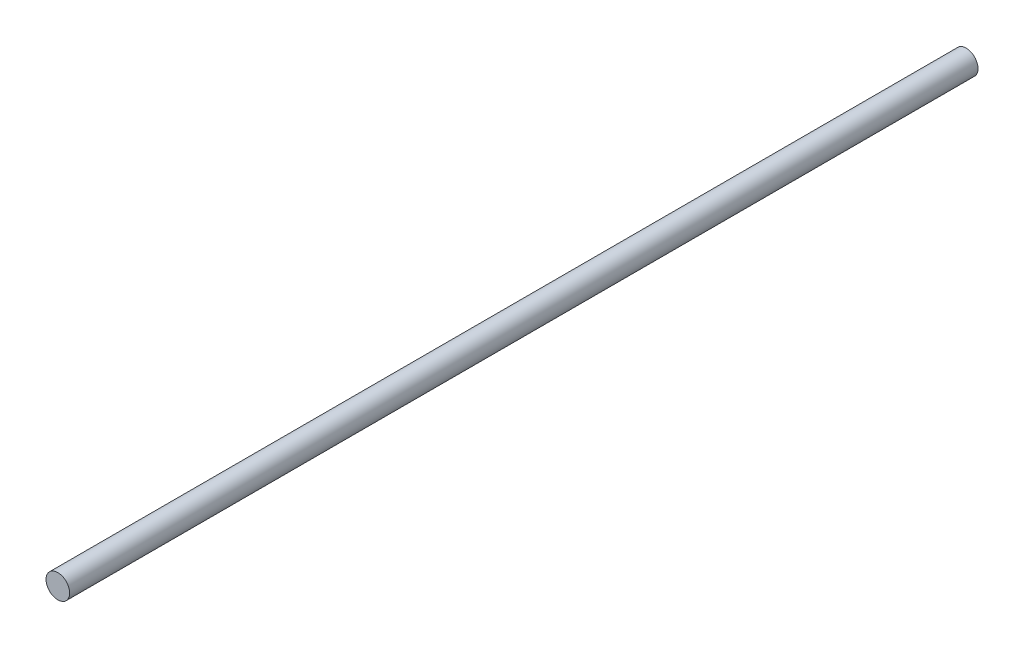
ISO-10303-21;
HEADER;
FILE_DESCRIPTION(('STEP AP214'),'2;1');
FILE_NAME('part.step','',(''),(''),'','','');
FILE_SCHEMA(('AUTOMOTIVE_DESIGN { 1 0 10303 214 1 1 1 1 }'));
ENDSEC;
DATA;
#1=APPLICATION_CONTEXT('core data for automotive mechanical design processes');
#2=APPLICATION_PROTOCOL_DEFINITION('international standard','automotive_design',2000,#1);
#3=PRODUCT_CONTEXT('',#1,'mechanical');
#4=PRODUCT('Part','Part','',(#3));
#5=PRODUCT_RELATED_PRODUCT_CATEGORY('part','',(#4));
#6=PRODUCT_DEFINITION_FORMATION('','',#4);
#7=PRODUCT_DEFINITION_CONTEXT('part definition',#1,'design');
#8=PRODUCT_DEFINITION('design','',#6,#7);
#9=PRODUCT_DEFINITION_SHAPE('','',#8);
#10=(LENGTH_UNIT() NAMED_UNIT(*) SI_UNIT(.MILLI.,.METRE.));
#11=(NAMED_UNIT(*) PLANE_ANGLE_UNIT() SI_UNIT($,.RADIAN.));
#12=(NAMED_UNIT(*) SI_UNIT($,.STERADIAN.) SOLID_ANGLE_UNIT());
#13=UNCERTAINTY_MEASURE_WITH_UNIT(LENGTH_MEASURE(1.E-05),#10,'distance_accuracy_value','');
#14=(GEOMETRIC_REPRESENTATION_CONTEXT(3) GLOBAL_UNCERTAINTY_ASSIGNED_CONTEXT((#13)) GLOBAL_UNIT_ASSIGNED_CONTEXT((#10,
#11,#12)) REPRESENTATION_CONTEXT('',''));
#15=CARTESIAN_POINT('',(0.,0.,0.));
#16=DIRECTION('',(0.,0.,1.));
#17=DIRECTION('',(1.,0.,0.));
#18=AXIS2_PLACEMENT_3D('',#15,#16,#17);
#19=CARTESIAN_POINT('',(0.,0.,152.4));
#20=DIRECTION('',(0.,0.,1.));
#21=DIRECTION('',(1.,0.,0.));
#22=AXIS2_PLACEMENT_3D('',#19,#20,#21);
#23=PLANE('',#22);
#24=CARTESIAN_POINT('',(0.,0.,152.4));
#25=DIRECTION('',(0.,0.,1.));
#26=DIRECTION('',(1.,0.,0.));
#27=AXIS2_PLACEMENT_3D('',#24,#25,#26);
#28=CIRCLE('',#27,3.96874999999997);
#29=CARTESIAN_POINT('',(3.96874999999997,0.,152.4));
#30=VERTEX_POINT('',#29);
#31=EDGE_CURVE('E11',#30,#30,#28,.F.);
#32=ORIENTED_EDGE('',*,*,#31,.F.);
#33=EDGE_LOOP('',(#32));
#34=FACE_BOUND('',#33,.T.);
#35=ADVANCED_FACE('F39',(#34),#23,.T.);
#36=CARTESIAN_POINT('',(0.,0.,-152.4));
#37=DIRECTION('',(0.,0.,-1.));
#38=DIRECTION('',(-1.,0.,0.));
#39=AXIS2_PLACEMENT_3D('',#36,#37,#38);
#40=PLANE('',#39);
#41=CARTESIAN_POINT('',(0.,0.,-152.4));
#42=DIRECTION('',(0.,0.,-1.));
#43=DIRECTION('',(-1.,0.,0.));
#44=AXIS2_PLACEMENT_3D('',#41,#42,#43);
#45=CIRCLE('',#44,3.96874999999997);
#46=CARTESIAN_POINT('',(-3.96874999999997,0.,-152.4));
#47=VERTEX_POINT('',#46);
#48=EDGE_CURVE('E46',#47,#47,#45,.T.);
#49=ORIENTED_EDGE('',*,*,#48,.T.);
#50=EDGE_LOOP('',(#49));
#51=FACE_BOUND('',#50,.T.);
#52=ADVANCED_FACE('F52',(#51),#40,.T.);
#53=CARTESIAN_POINT('',(0.,0.,152.4));
#54=DIRECTION('',(0.,0.,-1.));
#55=DIRECTION('',(-1.,0.,0.));
#56=AXIS2_PLACEMENT_3D('',#53,#54,#55);
#57=CYLINDRICAL_SURFACE('',#56,3.96875);
#58=ORIENTED_EDGE('',*,*,#31,.T.);
#59=EDGE_LOOP('',(#58));
#60=FACE_BOUND('',#59,.T.);
#61=ORIENTED_EDGE('',*,*,#48,.F.);
#62=EDGE_LOOP('',(#61));
#63=FACE_BOUND('',#62,.T.);
#64=ADVANCED_FACE('F41',(#60,#63),#57,.T.);
#65=CLOSED_SHELL('',(#35,#52,#64));
#66=MANIFOLD_SOLID_BREP('B2',#65);
#67=ADVANCED_BREP_SHAPE_REPRESENTATION('',(#18,#66),#14);
#68=SHAPE_DEFINITION_REPRESENTATION(#9,#67);
ENDSEC;
END-ISO-10303-21;
